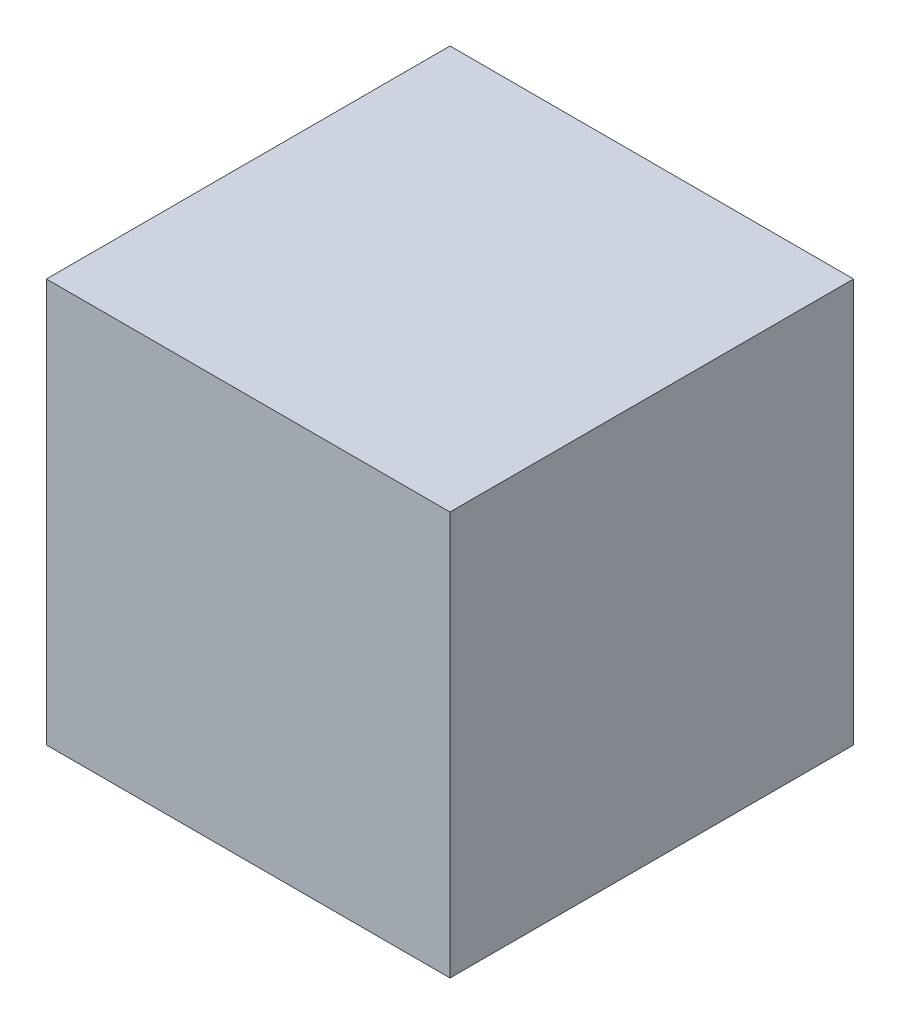
ISO-10303-21;
HEADER;
FILE_DESCRIPTION(('STEP AP214'),'2;1');
FILE_NAME('part.step','',(''),(''),'','','');
FILE_SCHEMA(('AUTOMOTIVE_DESIGN { 1 0 10303 214 1 1 1 1 }'));
ENDSEC;
DATA;
#1=APPLICATION_CONTEXT('core data for automotive mechanical design processes');
#2=APPLICATION_PROTOCOL_DEFINITION('international standard','automotive_design',2000,#1);
#3=PRODUCT_CONTEXT('',#1,'mechanical');
#4=PRODUCT('Part','Part','',(#3));
#5=PRODUCT_RELATED_PRODUCT_CATEGORY('part','',(#4));
#6=PRODUCT_DEFINITION_FORMATION('','',#4);
#7=PRODUCT_DEFINITION_CONTEXT('part definition',#1,'design');
#8=PRODUCT_DEFINITION('design','',#6,#7);
#9=PRODUCT_DEFINITION_SHAPE('','',#8);
#10=(LENGTH_UNIT() NAMED_UNIT(*) SI_UNIT(.MILLI.,.METRE.));
#11=(NAMED_UNIT(*) PLANE_ANGLE_UNIT() SI_UNIT($,.RADIAN.));
#12=(NAMED_UNIT(*) SI_UNIT($,.STERADIAN.) SOLID_ANGLE_UNIT());
#13=UNCERTAINTY_MEASURE_WITH_UNIT(LENGTH_MEASURE(1.E-05),#10,'distance_accuracy_value','');
#14=(GEOMETRIC_REPRESENTATION_CONTEXT(3) GLOBAL_UNCERTAINTY_ASSIGNED_CONTEXT((#13)) GLOBAL_UNIT_ASSIGNED_CONTEXT((#10,
#11,#12)) REPRESENTATION_CONTEXT('',''));
#15=CARTESIAN_POINT('',(0.,0.,0.));
#16=DIRECTION('',(0.,0.,1.));
#17=DIRECTION('',(1.,0.,0.));
#18=AXIS2_PLACEMENT_3D('',#15,#16,#17);
#19=CARTESIAN_POINT('',(0.60325,-0.34925,0.34925));
#20=DIRECTION('',(1.,0.,0.));
#21=DIRECTION('',(0.,0.,-1.));
#22=AXIS2_PLACEMENT_3D('',#19,#20,#21);
#23=PLANE('',#22);
#24=DIRECTION('',(0.,0.,1.));
#25=VECTOR('',#24,1.);
#26=CARTESIAN_POINT('',(0.60325,0.60325,-0.60325));
#27=LINE('',#26,#25);
#28=CARTESIAN_POINT('',(0.60325,0.60325,0.34925));
#29=VERTEX_POINT('',#28);
#30=CARTESIAN_POINT('',(0.60325,0.60325,-0.60325));
#31=VERTEX_POINT('',#30);
#32=EDGE_CURVE('E93',#29,#31,#27,.F.);
#33=ORIENTED_EDGE('',*,*,#32,.F.);
#34=DIRECTION('',(0.,1.,0.));
#35=VECTOR('',#34,1.);
#36=CARTESIAN_POINT('',(0.60325,0.60325,0.34925));
#37=LINE('',#36,#35);
#38=CARTESIAN_POINT('',(0.60325,-0.34925,0.34925));
#39=VERTEX_POINT('',#38);
#40=EDGE_CURVE('E43',#39,#29,#37,.T.);
#41=ORIENTED_EDGE('',*,*,#40,.F.);
#42=DIRECTION('',(0.,0.,-1.));
#43=VECTOR('',#42,1.);
#44=CARTESIAN_POINT('',(0.60325,-0.34925,0.34925));
#45=LINE('',#44,#43);
#46=CARTESIAN_POINT('',(0.60325,-0.34925,-0.60325));
#47=VERTEX_POINT('',#46);
#48=EDGE_CURVE('E82',#47,#39,#45,.F.);
#49=ORIENTED_EDGE('',*,*,#48,.F.);
#50=DIRECTION('',(0.,1.,0.));
#51=VECTOR('',#50,1.);
#52=CARTESIAN_POINT('',(0.60325,-0.34925,-0.60325));
#53=LINE('',#52,#51);
#54=EDGE_CURVE('E77',#31,#47,#53,.F.);
#55=ORIENTED_EDGE('',*,*,#54,.F.);
#56=EDGE_LOOP('',(#33,#41,#49,#55));
#57=FACE_BOUND('',#56,.T.);
#58=ADVANCED_FACE('F40',(#57),#23,.T.);
#59=CARTESIAN_POINT('',(-0.34925,0.60325,0.34925));
#60=DIRECTION('',(0.,0.,1.));
#61=DIRECTION('',(1.,0.,0.));
#62=AXIS2_PLACEMENT_3D('',#59,#60,#61);
#63=PLANE('',#62);
#64=DIRECTION('',(1.,0.,0.));
#65=VECTOR('',#64,1.);
#66=CARTESIAN_POINT('',(-0.34925,0.60325,0.34925));
#67=LINE('',#66,#65);
#68=CARTESIAN_POINT('',(-0.34925,0.60325,0.34925));
#69=VERTEX_POINT('',#68);
#70=EDGE_CURVE('E108',#69,#29,#67,.T.);
#71=ORIENTED_EDGE('',*,*,#70,.F.);
#72=DIRECTION('',(0.,1.,0.));
#73=VECTOR('',#72,1.);
#74=CARTESIAN_POINT('',(-0.34925,-0.34925,0.34925));
#75=LINE('',#74,#73);
#76=CARTESIAN_POINT('',(-0.34925,-0.34925,0.34925));
#77=VERTEX_POINT('',#76);
#78=EDGE_CURVE('E100',#69,#77,#75,.F.);
#79=ORIENTED_EDGE('',*,*,#78,.T.);
#80=DIRECTION('',(1.,0.,0.));
#81=VECTOR('',#80,1.);
#82=CARTESIAN_POINT('',(-0.34925,-0.34925,0.34925));
#83=LINE('',#82,#81);
#84=EDGE_CURVE('E87',#39,#77,#83,.F.);
#85=ORIENTED_EDGE('',*,*,#84,.F.);
#86=ORIENTED_EDGE('',*,*,#40,.T.);
#87=EDGE_LOOP('',(#71,#79,#85,#86));
#88=FACE_BOUND('',#87,.T.);
#89=ADVANCED_FACE('F99',(#88),#63,.T.);
#90=CARTESIAN_POINT('',(-0.34925,-0.34925,0.34925));
#91=DIRECTION('',(0.,-1.,0.));
#92=DIRECTION('',(0.,0.,-1.));
#93=AXIS2_PLACEMENT_3D('',#90,#91,#92);
#94=PLANE('',#93);
#95=ORIENTED_EDGE('',*,*,#84,.T.);
#96=DIRECTION('',(0.,0.,-1.));
#97=VECTOR('',#96,1.);
#98=CARTESIAN_POINT('',(-0.34925,-0.34925,0.34925));
#99=LINE('',#98,#97);
#100=CARTESIAN_POINT('',(-0.34925,-0.34925,-0.60325));
#101=VERTEX_POINT('',#100);
#102=EDGE_CURVE('E117',#77,#101,#99,.T.);
#103=ORIENTED_EDGE('',*,*,#102,.T.);
#104=DIRECTION('',(-1.,0.,0.));
#105=VECTOR('',#104,1.);
#106=CARTESIAN_POINT('',(-0.34925,-0.34925,-0.60325));
#107=LINE('',#106,#105);
#108=EDGE_CURVE('E89',#47,#101,#107,.T.);
#109=ORIENTED_EDGE('',*,*,#108,.F.);
#110=ORIENTED_EDGE('',*,*,#48,.T.);
#111=EDGE_LOOP('',(#95,#103,#109,#110));
#112=FACE_BOUND('',#111,.T.);
#113=ADVANCED_FACE('F84',(#112),#94,.T.);
#114=CARTESIAN_POINT('',(-0.34925,-0.34925,-0.60325));
#115=DIRECTION('',(0.,0.,-1.));
#116=DIRECTION('',(-1.,0.,0.));
#117=AXIS2_PLACEMENT_3D('',#114,#115,#116);
#118=PLANE('',#117);
#119=ORIENTED_EDGE('',*,*,#108,.T.);
#120=DIRECTION('',(0.,1.,0.));
#121=VECTOR('',#120,1.);
#122=CARTESIAN_POINT('',(-0.34925,-0.34925,-0.60325));
#123=LINE('',#122,#121);
#124=CARTESIAN_POINT('',(-0.34925,0.60325,-0.60325));
#125=VERTEX_POINT('',#124);
#126=EDGE_CURVE('E50',#101,#125,#123,.T.);
#127=ORIENTED_EDGE('',*,*,#126,.T.);
#128=DIRECTION('',(1.,0.,0.));
#129=VECTOR('',#128,1.);
#130=CARTESIAN_POINT('',(-0.34925,0.60325,-0.60325));
#131=LINE('',#130,#129);
#132=EDGE_CURVE('E58',#31,#125,#131,.F.);
#133=ORIENTED_EDGE('',*,*,#132,.F.);
#134=ORIENTED_EDGE('',*,*,#54,.T.);
#135=EDGE_LOOP('',(#119,#127,#133,#134));
#136=FACE_BOUND('',#135,.T.);
#137=ADVANCED_FACE('F123',(#136),#118,.T.);
#138=CARTESIAN_POINT('',(-0.34925,0.60325,-0.60325));
#139=DIRECTION('',(0.,1.,0.));
#140=DIRECTION('',(0.,0.,1.));
#141=AXIS2_PLACEMENT_3D('',#138,#139,#140);
#142=PLANE('',#141);
#143=ORIENTED_EDGE('',*,*,#132,.T.);
#144=DIRECTION('',(0.,0.,-1.));
#145=VECTOR('',#144,1.);
#146=CARTESIAN_POINT('',(-0.34925,0.60325,0.34925));
#147=LINE('',#146,#145);
#148=EDGE_CURVE('E11',#125,#69,#147,.F.);
#149=ORIENTED_EDGE('',*,*,#148,.T.);
#150=ORIENTED_EDGE('',*,*,#70,.T.);
#151=ORIENTED_EDGE('',*,*,#32,.T.);
#152=EDGE_LOOP('',(#143,#149,#150,#151));
#153=FACE_BOUND('',#152,.T.);
#154=ADVANCED_FACE('F126',(#153),#142,.T.);
#155=CARTESIAN_POINT('',(-0.34925,-0.34925,0.34925));
#156=DIRECTION('',(1.,0.,0.));
#157=DIRECTION('',(0.,0.,-1.));
#158=AXIS2_PLACEMENT_3D('',#155,#156,#157);
#159=PLANE('',#158);
#160=ORIENTED_EDGE('',*,*,#126,.F.);
#161=ORIENTED_EDGE('',*,*,#102,.F.);
#162=ORIENTED_EDGE('',*,*,#78,.F.);
#163=ORIENTED_EDGE('',*,*,#148,.F.);
#164=EDGE_LOOP('',(#160,#161,#162,#163));
#165=FACE_BOUND('',#164,.T.);
#166=ADVANCED_FACE('F125',(#165),#159,.F.);
#167=CLOSED_SHELL('',(#58,#89,#113,#137,#154,#166));
#168=MANIFOLD_SOLID_BREP('B2',#167);
#169=ADVANCED_BREP_SHAPE_REPRESENTATION('',(#18,#168),#14);
#170=SHAPE_DEFINITION_REPRESENTATION(#9,#169);
ENDSEC;
END-ISO-10303-21;
